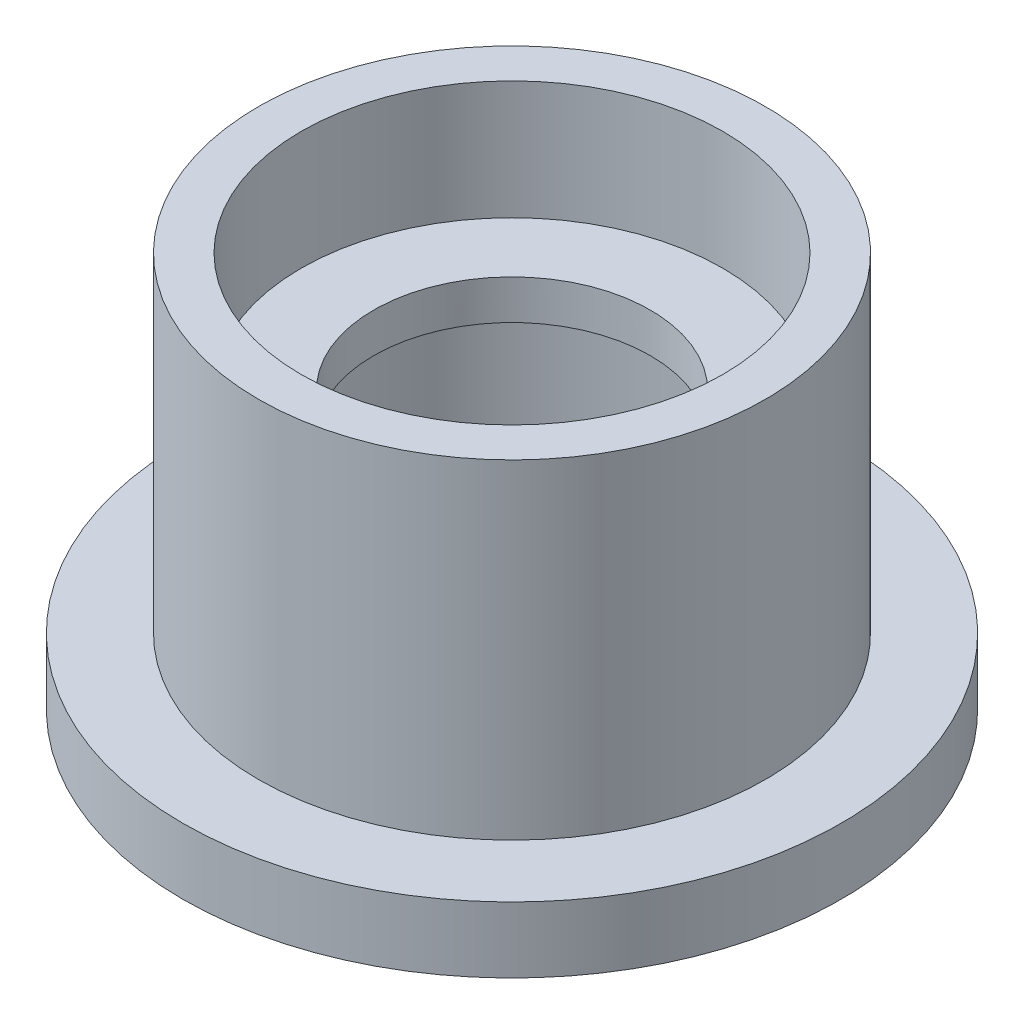
ISO-10303-21;
HEADER;
FILE_DESCRIPTION(('STEP AP214'),'2;1');
FILE_NAME('part.step','',(''),(''),'','','');
FILE_SCHEMA(('AUTOMOTIVE_DESIGN { 1 0 10303 214 1 1 1 1 }'));
ENDSEC;
DATA;
#1=APPLICATION_CONTEXT('core data for automotive mechanical design processes');
#2=APPLICATION_PROTOCOL_DEFINITION('international standard','automotive_design',2000,#1);
#3=PRODUCT_CONTEXT('',#1,'mechanical');
#4=PRODUCT('Part','Part','',(#3));
#5=PRODUCT_RELATED_PRODUCT_CATEGORY('part','',(#4));
#6=PRODUCT_DEFINITION_FORMATION('','',#4);
#7=PRODUCT_DEFINITION_CONTEXT('part definition',#1,'design');
#8=PRODUCT_DEFINITION('design','',#6,#7);
#9=PRODUCT_DEFINITION_SHAPE('','',#8);
#10=(LENGTH_UNIT() NAMED_UNIT(*) SI_UNIT(.MILLI.,.METRE.));
#11=(NAMED_UNIT(*) PLANE_ANGLE_UNIT() SI_UNIT($,.RADIAN.));
#12=(NAMED_UNIT(*) SI_UNIT($,.STERADIAN.) SOLID_ANGLE_UNIT());
#13=UNCERTAINTY_MEASURE_WITH_UNIT(LENGTH_MEASURE(1.E-05),#10,'distance_accuracy_value','');
#14=(GEOMETRIC_REPRESENTATION_CONTEXT(3) GLOBAL_UNCERTAINTY_ASSIGNED_CONTEXT((#13)) GLOBAL_UNIT_ASSIGNED_CONTEXT((#10,
#11,#12)) REPRESENTATION_CONTEXT('',''));
#15=CARTESIAN_POINT('',(0.,0.,0.));
#16=DIRECTION('',(0.,0.,1.));
#17=DIRECTION('',(1.,0.,0.));
#18=AXIS2_PLACEMENT_3D('',#15,#16,#17);
#19=CARTESIAN_POINT('',(0.,0.,0.));
#20=DIRECTION('',(0.,1.,0.));
#21=DIRECTION('',(0.,0.,1.));
#22=AXIS2_PLACEMENT_3D('',#19,#20,#21);
#23=CYLINDRICAL_SURFACE('',#22,10.5);
#24=CARTESIAN_POINT('',(0.,21.,0.));
#25=DIRECTION('',(0.,1.,0.));
#26=DIRECTION('',(0.,0.,1.));
#27=AXIS2_PLACEMENT_3D('',#24,#25,#26);
#28=CIRCLE('',#27,10.5);
#29=CARTESIAN_POINT('',(0.,21.,10.5));
#30=VERTEX_POINT('',#29);
#31=EDGE_CURVE('E58',#30,#30,#28,.T.);
#32=ORIENTED_EDGE('',*,*,#31,.T.);
#33=EDGE_LOOP('',(#32));
#34=FACE_BOUND('',#33,.T.);
#35=CARTESIAN_POINT('',(0.,18.,0.));
#36=DIRECTION('',(0.,-1.,0.));
#37=DIRECTION('',(0.,0.,-1.));
#38=AXIS2_PLACEMENT_3D('',#35,#36,#37);
#39=CIRCLE('',#38,10.5);
#40=CARTESIAN_POINT('',(0.,18.,-10.5));
#41=VERTEX_POINT('',#40);
#42=EDGE_CURVE('E38',#41,#41,#39,.F.);
#43=ORIENTED_EDGE('',*,*,#42,.F.);
#44=EDGE_LOOP('',(#43));
#45=FACE_BOUND('',#44,.T.);
#46=ADVANCED_FACE('F34',(#34,#45),#23,.F.);
#47=CARTESIAN_POINT('',(0.,30.,0.));
#48=DIRECTION('',(0.,-1.,0.));
#49=DIRECTION('',(0.,0.,-1.));
#50=AXIS2_PLACEMENT_3D('',#47,#48,#49);
#51=CYLINDRICAL_SURFACE('',#50,25.);
#52=CARTESIAN_POINT('',(0.,0.,0.));
#53=DIRECTION('',(0.,1.,0.));
#54=DIRECTION('',(0.,0.,1.));
#55=AXIS2_PLACEMENT_3D('',#52,#53,#54);
#56=CIRCLE('',#55,25.);
#57=CARTESIAN_POINT('',(0.,0.,25.));
#58=VERTEX_POINT('',#57);
#59=EDGE_CURVE('E12',#58,#58,#56,.T.);
#60=ORIENTED_EDGE('',*,*,#59,.T.);
#61=EDGE_LOOP('',(#60));
#62=FACE_BOUND('',#61,.T.);
#63=CARTESIAN_POINT('',(0.,5.,0.));
#64=DIRECTION('',(0.,1.,0.));
#65=DIRECTION('',(0.,0.,1.));
#66=AXIS2_PLACEMENT_3D('',#63,#64,#65);
#67=CIRCLE('',#66,25.);
#68=CARTESIAN_POINT('',(0.,5.,25.));
#69=VERTEX_POINT('',#68);
#70=EDGE_CURVE('E42',#69,#69,#67,.T.);
#71=ORIENTED_EDGE('',*,*,#70,.F.);
#72=EDGE_LOOP('',(#71));
#73=FACE_BOUND('',#72,.T.);
#74=ADVANCED_FACE('F36',(#62,#73),#51,.T.);
#75=CARTESIAN_POINT('',(0.,0.,0.));
#76=DIRECTION('',(0.,1.,0.));
#77=DIRECTION('',(0.,0.,1.));
#78=AXIS2_PLACEMENT_3D('',#75,#76,#77);
#79=PLANE('',#78);
#80=CARTESIAN_POINT('',(0.,0.,0.));
#81=DIRECTION('',(0.,-1.,0.));
#82=DIRECTION('',(0.,0.,-1.));
#83=AXIS2_PLACEMENT_3D('',#80,#81,#82);
#84=CIRCLE('',#83,16.);
#85=CARTESIAN_POINT('',(0.,0.,-16.));
#86=VERTEX_POINT('',#85);
#87=EDGE_CURVE('E63',#86,#86,#84,.T.);
#88=ORIENTED_EDGE('',*,*,#87,.F.);
#89=EDGE_LOOP('',(#88));
#90=FACE_BOUND('',#89,.T.);
#91=ORIENTED_EDGE('',*,*,#59,.F.);
#92=EDGE_LOOP('',(#91));
#93=FACE_BOUND('',#92,.T.);
#94=ADVANCED_FACE('F81',(#90,#93),#79,.F.);
#95=CARTESIAN_POINT('',(0.,5.,0.));
#96=DIRECTION('',(0.,1.,0.));
#97=DIRECTION('',(0.,0.,1.));
#98=AXIS2_PLACEMENT_3D('',#95,#96,#97);
#99=PLANE('',#98);
#100=CARTESIAN_POINT('',(0.,5.,0.));
#101=DIRECTION('',(0.,1.,0.));
#102=DIRECTION('',(0.,0.,1.));
#103=AXIS2_PLACEMENT_3D('',#100,#101,#102);
#104=CIRCLE('',#103,19.25);
#105=CARTESIAN_POINT('',(0.,5.,19.25));
#106=VERTEX_POINT('',#105);
#107=EDGE_CURVE('E47',#106,#106,#104,.F.);
#108=ORIENTED_EDGE('',*,*,#107,.T.);
#109=EDGE_LOOP('',(#108));
#110=FACE_BOUND('',#109,.T.);
#111=ORIENTED_EDGE('',*,*,#70,.T.);
#112=EDGE_LOOP('',(#111));
#113=FACE_BOUND('',#112,.T.);
#114=ADVANCED_FACE('F95',(#110,#113),#99,.T.);
#115=CARTESIAN_POINT('',(0.,-72.9137073867888,0.));
#116=DIRECTION('',(0.,1.,0.));
#117=DIRECTION('',(0.,0.,1.));
#118=AXIS2_PLACEMENT_3D('',#115,#116,#117);
#119=CYLINDRICAL_SURFACE('',#118,19.25);
#120=ORIENTED_EDGE('',*,*,#107,.F.);
#121=EDGE_LOOP('',(#120));
#122=FACE_BOUND('',#121,.T.);
#123=CARTESIAN_POINT('',(0.,30.,0.));
#124=DIRECTION('',(0.,1.,0.));
#125=DIRECTION('',(0.,0.,1.));
#126=AXIS2_PLACEMENT_3D('',#123,#124,#125);
#127=CIRCLE('',#126,19.25);
#128=CARTESIAN_POINT('',(0.,30.,19.25));
#129=VERTEX_POINT('',#128);
#130=EDGE_CURVE('E51',#129,#129,#127,.T.);
#131=ORIENTED_EDGE('',*,*,#130,.F.);
#132=EDGE_LOOP('',(#131));
#133=FACE_BOUND('',#132,.T.);
#134=ADVANCED_FACE('F98',(#122,#133),#119,.T.);
#135=CARTESIAN_POINT('',(0.,30.,0.));
#136=DIRECTION('',(0.,1.,0.));
#137=DIRECTION('',(0.,0.,1.));
#138=AXIS2_PLACEMENT_3D('',#135,#136,#137);
#139=PLANE('',#138);
#140=CARTESIAN_POINT('',(0.,30.,0.));
#141=DIRECTION('',(0.,1.,0.));
#142=DIRECTION('',(0.,0.,1.));
#143=AXIS2_PLACEMENT_3D('',#140,#141,#142);
#144=CIRCLE('',#143,16.);
#145=CARTESIAN_POINT('',(0.,30.,16.));
#146=VERTEX_POINT('',#145);
#147=EDGE_CURVE('E55',#146,#146,#144,.T.);
#148=ORIENTED_EDGE('',*,*,#147,.F.);
#149=EDGE_LOOP('',(#148));
#150=FACE_BOUND('',#149,.T.);
#151=ORIENTED_EDGE('',*,*,#130,.T.);
#152=EDGE_LOOP('',(#151));
#153=FACE_BOUND('',#152,.T.);
#154=ADVANCED_FACE('F93',(#150,#153),#139,.T.);
#155=CARTESIAN_POINT('',(0.,21.,0.));
#156=DIRECTION('',(0.,1.,0.));
#157=DIRECTION('',(0.,0.,1.));
#158=AXIS2_PLACEMENT_3D('',#155,#156,#157);
#159=CYLINDRICAL_SURFACE('',#158,16.);
#160=CARTESIAN_POINT('',(0.,21.,0.));
#161=DIRECTION('',(0.,1.,0.));
#162=DIRECTION('',(0.,0.,1.));
#163=AXIS2_PLACEMENT_3D('',#160,#161,#162);
#164=CIRCLE('',#163,16.);
#165=CARTESIAN_POINT('',(0.,21.,16.));
#166=VERTEX_POINT('',#165);
#167=EDGE_CURVE('E54',#166,#166,#164,.T.);
#168=ORIENTED_EDGE('',*,*,#167,.F.);
#169=EDGE_LOOP('',(#168));
#170=FACE_BOUND('',#169,.T.);
#171=ORIENTED_EDGE('',*,*,#147,.T.);
#172=EDGE_LOOP('',(#171));
#173=FACE_BOUND('',#172,.T.);
#174=ADVANCED_FACE('F89',(#170,#173),#159,.F.);
#175=CARTESIAN_POINT('',(0.,21.,0.));
#176=DIRECTION('',(0.,1.,0.));
#177=DIRECTION('',(0.,0.,1.));
#178=AXIS2_PLACEMENT_3D('',#175,#176,#177);
#179=PLANE('',#178);
#180=ORIENTED_EDGE('',*,*,#31,.F.);
#181=EDGE_LOOP('',(#180));
#182=FACE_BOUND('',#181,.T.);
#183=ORIENTED_EDGE('',*,*,#167,.T.);
#184=EDGE_LOOP('',(#183));
#185=FACE_BOUND('',#184,.T.);
#186=ADVANCED_FACE('F86',(#182,#185),#179,.T.);
#187=CARTESIAN_POINT('',(0.,18.,0.));
#188=DIRECTION('',(0.,-1.,0.));
#189=DIRECTION('',(0.,0.,-1.));
#190=AXIS2_PLACEMENT_3D('',#187,#188,#189);
#191=PLANE('',#190);
#192=CARTESIAN_POINT('',(0.,18.,0.));
#193=DIRECTION('',(0.,-1.,0.));
#194=DIRECTION('',(0.,0.,-1.));
#195=AXIS2_PLACEMENT_3D('',#192,#193,#194);
#196=CIRCLE('',#195,16.);
#197=CARTESIAN_POINT('',(0.,18.,-16.));
#198=VERTEX_POINT('',#197);
#199=EDGE_CURVE('E66',#198,#198,#196,.T.);
#200=ORIENTED_EDGE('',*,*,#199,.T.);
#201=EDGE_LOOP('',(#200));
#202=FACE_BOUND('',#201,.T.);
#203=ORIENTED_EDGE('',*,*,#42,.T.);
#204=EDGE_LOOP('',(#203));
#205=FACE_BOUND('',#204,.T.);
#206=ADVANCED_FACE('F73',(#202,#205),#191,.T.);
#207=CARTESIAN_POINT('',(0.,18.,0.));
#208=DIRECTION('',(0.,-1.,0.));
#209=DIRECTION('',(0.,0.,-1.));
#210=AXIS2_PLACEMENT_3D('',#207,#208,#209);
#211=CYLINDRICAL_SURFACE('',#210,16.);
#212=ORIENTED_EDGE('',*,*,#199,.F.);
#213=EDGE_LOOP('',(#212));
#214=FACE_BOUND('',#213,.T.);
#215=ORIENTED_EDGE('',*,*,#87,.T.);
#216=EDGE_LOOP('',(#215));
#217=FACE_BOUND('',#216,.T.);
#218=ADVANCED_FACE('F84',(#214,#217),#211,.F.);
#219=CLOSED_SHELL('',(#46,#74,#94,#114,#134,#154,#174,#186,#206,#218));
#220=MANIFOLD_SOLID_BREP('B2',#219);
#221=ADVANCED_BREP_SHAPE_REPRESENTATION('',(#18,#220),#14);
#222=SHAPE_DEFINITION_REPRESENTATION(#9,#221);
ENDSEC;
END-ISO-10303-21;
